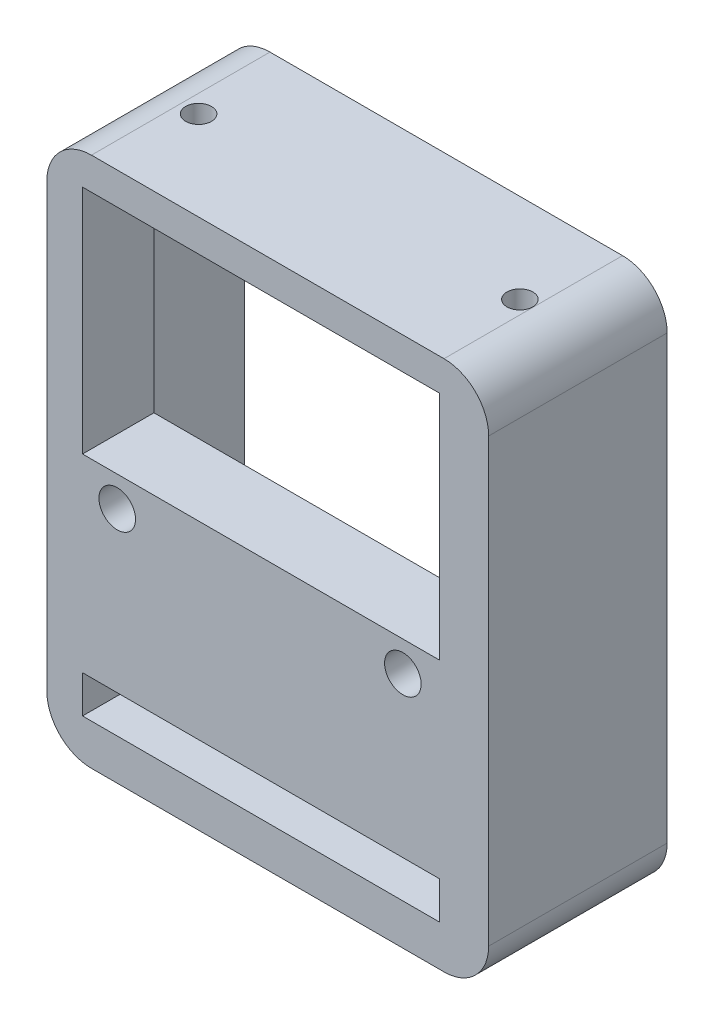
ISO-10303-21;
HEADER;
FILE_DESCRIPTION(('STEP AP214'),'2;1');
FILE_NAME('part.step','',(''),(''),'','','');
FILE_SCHEMA(('AUTOMOTIVE_DESIGN { 1 0 10303 214 1 1 1 1 }'));
ENDSEC;
DATA;
#1=APPLICATION_CONTEXT('core data for automotive mechanical design processes');
#2=APPLICATION_PROTOCOL_DEFINITION('international standard','automotive_design',2000,#1);
#3=PRODUCT_CONTEXT('',#1,'mechanical');
#4=PRODUCT('Part','Part','',(#3));
#5=PRODUCT_RELATED_PRODUCT_CATEGORY('part','',(#4));
#6=PRODUCT_DEFINITION_FORMATION('','',#4);
#7=PRODUCT_DEFINITION_CONTEXT('part definition',#1,'design');
#8=PRODUCT_DEFINITION('design','',#6,#7);
#9=PRODUCT_DEFINITION_SHAPE('','',#8);
#10=(LENGTH_UNIT() NAMED_UNIT(*) SI_UNIT(.MILLI.,.METRE.));
#11=(NAMED_UNIT(*) PLANE_ANGLE_UNIT() SI_UNIT($,.RADIAN.));
#12=(NAMED_UNIT(*) SI_UNIT($,.STERADIAN.) SOLID_ANGLE_UNIT());
#13=UNCERTAINTY_MEASURE_WITH_UNIT(LENGTH_MEASURE(1.E-05),#10,'distance_accuracy_value','');
#14=(GEOMETRIC_REPRESENTATION_CONTEXT(3) GLOBAL_UNCERTAINTY_ASSIGNED_CONTEXT((#13)) GLOBAL_UNIT_ASSIGNED_CONTEXT((#10,
#11,#12)) REPRESENTATION_CONTEXT('',''));
#15=CARTESIAN_POINT('',(0.,0.,0.));
#16=DIRECTION('',(0.,0.,1.));
#17=DIRECTION('',(1.,0.,0.));
#18=AXIS2_PLACEMENT_3D('',#15,#16,#17);
#19=CARTESIAN_POINT('',(15.138,-3.116,20.));
#20=DIRECTION('',(0.,0.,-1.));
#21=DIRECTION('',(-1.,0.,0.));
#22=AXIS2_PLACEMENT_3D('',#19,#20,#21);
#23=CYLINDRICAL_SURFACE('',#22,1.45);
#24=CARTESIAN_POINT('',(15.138,-3.116,12.));
#25=DIRECTION('',(0.,0.,-1.));
#26=DIRECTION('',(-1.,0.,0.));
#27=AXIS2_PLACEMENT_3D('',#24,#25,#26);
#28=CIRCLE('',#27,1.45);
#29=CARTESIAN_POINT('',(13.688,-3.116,12.));
#30=VERTEX_POINT('',#29);
#31=EDGE_CURVE('E343',#30,#30,#28,.T.);
#32=ORIENTED_EDGE('',*,*,#31,.T.);
#33=EDGE_LOOP('',(#32));
#34=FACE_BOUND('',#33,.T.);
#35=CARTESIAN_POINT('',(15.138,-3.116,14.));
#36=DIRECTION('',(0.,0.,1.));
#37=DIRECTION('',(1.,0.,0.));
#38=AXIS2_PLACEMENT_3D('',#35,#36,#37);
#39=CIRCLE('',#38,1.45);
#40=CARTESIAN_POINT('',(16.588,-3.116,14.));
#41=VERTEX_POINT('',#40);
#42=EDGE_CURVE('E339',#41,#41,#39,.F.);
#43=ORIENTED_EDGE('',*,*,#42,.F.);
#44=EDGE_LOOP('',(#43));
#45=FACE_BOUND('',#44,.T.);
#46=ADVANCED_FACE('F41',(#34,#45),#23,.F.);
#47=CARTESIAN_POINT('',(-16.862,-3.116,20.));
#48=DIRECTION('',(0.,0.,-1.));
#49=DIRECTION('',(-1.,0.,0.));
#50=AXIS2_PLACEMENT_3D('',#47,#48,#49);
#51=CYLINDRICAL_SURFACE('',#50,1.45);
#52=CARTESIAN_POINT('',(-16.862,-3.116,12.));
#53=DIRECTION('',(0.,0.,-1.));
#54=DIRECTION('',(-1.,0.,0.));
#55=AXIS2_PLACEMENT_3D('',#52,#53,#54);
#56=CIRCLE('',#55,1.45);
#57=CARTESIAN_POINT('',(-18.312,-3.116,12.));
#58=VERTEX_POINT('',#57);
#59=EDGE_CURVE('E215',#58,#58,#56,.T.);
#60=ORIENTED_EDGE('',*,*,#59,.T.);
#61=EDGE_LOOP('',(#60));
#62=FACE_BOUND('',#61,.T.);
#63=CARTESIAN_POINT('',(-16.862,-3.116,14.));
#64=DIRECTION('',(0.,0.,1.));
#65=DIRECTION('',(1.,0.,0.));
#66=AXIS2_PLACEMENT_3D('',#63,#64,#65);
#67=CIRCLE('',#66,1.45);
#68=CARTESIAN_POINT('',(-15.412,-3.116,14.));
#69=VERTEX_POINT('',#68);
#70=EDGE_CURVE('E336',#69,#69,#67,.F.);
#71=ORIENTED_EDGE('',*,*,#70,.F.);
#72=EDGE_LOOP('',(#71));
#73=FACE_BOUND('',#72,.T.);
#74=ADVANCED_FACE('F416',(#62,#73),#51,.F.);
#75=CARTESIAN_POINT('',(19.75,-24.75,20.));
#76=DIRECTION('',(0.,0.,1.));
#77=DIRECTION('',(1.,0.,0.));
#78=AXIS2_PLACEMENT_3D('',#75,#76,#77);
#79=PLANE('',#78);
#80=CARTESIAN_POINT('',(-16.862,-3.116,20.));
#81=DIRECTION('',(0.,0.,1.));
#82=DIRECTION('',(1.,0.,0.));
#83=AXIS2_PLACEMENT_3D('',#80,#81,#82);
#84=CIRCLE('',#83,2.05);
#85=CARTESIAN_POINT('',(-14.812,-3.116,20.));
#86=VERTEX_POINT('',#85);
#87=EDGE_CURVE('E372',#86,#86,#84,.T.);
#88=ORIENTED_EDGE('',*,*,#87,.F.);
#89=EDGE_LOOP('',(#88));
#90=FACE_BOUND('',#89,.T.);
#91=CARTESIAN_POINT('',(15.138,-3.116,20.));
#92=DIRECTION('',(0.,0.,1.));
#93=DIRECTION('',(1.,0.,0.));
#94=AXIS2_PLACEMENT_3D('',#91,#92,#93);
#95=CIRCLE('',#94,2.05);
#96=CARTESIAN_POINT('',(17.188,-3.116,20.));
#97=VERTEX_POINT('',#96);
#98=EDGE_CURVE('E375',#97,#97,#95,.T.);
#99=ORIENTED_EDGE('',*,*,#98,.F.);
#100=EDGE_LOOP('',(#99));
#101=FACE_BOUND('',#100,.T.);
#102=CARTESIAN_POINT('',(19.75,-24.75,20.));
#103=DIRECTION('',(0.,0.,1.));
#104=DIRECTION('',(1.,0.,0.));
#105=AXIS2_PLACEMENT_3D('',#102,#103,#104);
#106=CIRCLE('',#105,4.99999999999999);
#107=CARTESIAN_POINT('',(19.75,-29.75,20.));
#108=VERTEX_POINT('',#107);
#109=CARTESIAN_POINT('',(24.75,-24.75,20.));
#110=VERTEX_POINT('',#109);
#111=EDGE_CURVE('E264',#108,#110,#106,.T.);
#112=ORIENTED_EDGE('',*,*,#111,.T.);
#113=DIRECTION('',(0.,1.,0.));
#114=VECTOR('',#113,1.);
#115=CARTESIAN_POINT('',(24.75,24.75,20.));
#116=LINE('',#115,#114);
#117=CARTESIAN_POINT('',(24.75,24.75,20.));
#118=VERTEX_POINT('',#117);
#119=EDGE_CURVE('E267',#110,#118,#116,.T.);
#120=ORIENTED_EDGE('',*,*,#119,.T.);
#121=CARTESIAN_POINT('',(19.75,24.75,20.));
#122=DIRECTION('',(0.,0.,1.));
#123=DIRECTION('',(-1.,0.,0.));
#124=AXIS2_PLACEMENT_3D('',#121,#122,#123);
#125=CIRCLE('',#124,4.99999999999999);
#126=CARTESIAN_POINT('',(19.75,29.75,20.));
#127=VERTEX_POINT('',#126);
#128=EDGE_CURVE('E270',#118,#127,#125,.T.);
#129=ORIENTED_EDGE('',*,*,#128,.T.);
#130=DIRECTION('',(-1.,0.,0.));
#131=VECTOR('',#130,1.);
#132=CARTESIAN_POINT('',(-19.75,29.75,20.));
#133=LINE('',#132,#131);
#134=CARTESIAN_POINT('',(-19.75,29.75,20.));
#135=VERTEX_POINT('',#134);
#136=EDGE_CURVE('E272',#127,#135,#133,.T.);
#137=ORIENTED_EDGE('',*,*,#136,.T.);
#138=CARTESIAN_POINT('',(-19.75,24.75,20.));
#139=DIRECTION('',(0.,0.,1.));
#140=DIRECTION('',(1.,0.,0.));
#141=AXIS2_PLACEMENT_3D('',#138,#139,#140);
#142=CIRCLE('',#141,4.99999999999999);
#143=CARTESIAN_POINT('',(-24.75,24.75,20.));
#144=VERTEX_POINT('',#143);
#145=EDGE_CURVE('E274',#135,#144,#142,.T.);
#146=ORIENTED_EDGE('',*,*,#145,.T.);
#147=DIRECTION('',(0.,-1.,0.));
#148=VECTOR('',#147,1.);
#149=CARTESIAN_POINT('',(-24.75,24.75,20.));
#150=LINE('',#149,#148);
#151=CARTESIAN_POINT('',(-24.75,-24.75,20.));
#152=VERTEX_POINT('',#151);
#153=EDGE_CURVE('E276',#144,#152,#150,.T.);
#154=ORIENTED_EDGE('',*,*,#153,.T.);
#155=CARTESIAN_POINT('',(-19.75,-24.75,20.));
#156=DIRECTION('',(0.,0.,1.));
#157=DIRECTION('',(1.,0.,0.));
#158=AXIS2_PLACEMENT_3D('',#155,#156,#157);
#159=CIRCLE('',#158,4.99999999999999);
#160=CARTESIAN_POINT('',(-19.75,-29.75,20.));
#161=VERTEX_POINT('',#160);
#162=EDGE_CURVE('E278',#152,#161,#159,.T.);
#163=ORIENTED_EDGE('',*,*,#162,.T.);
#164=DIRECTION('',(1.,0.,0.));
#165=VECTOR('',#164,1.);
#166=CARTESIAN_POINT('',(-19.75,-29.75,20.));
#167=LINE('',#166,#165);
#168=EDGE_CURVE('E280',#161,#108,#167,.T.);
#169=ORIENTED_EDGE('',*,*,#168,.T.);
#170=EDGE_LOOP('',(#112,#120,#129,#137,#146,#154,#163,#169));
#171=FACE_BOUND('',#170,.T.);
#172=DIRECTION('',(1.,0.,0.));
#173=VECTOR('',#172,1.);
#174=CARTESIAN_POINT('',(0.,-20.9650496624066,20.));
#175=LINE('',#174,#173);
#176=CARTESIAN_POINT('',(-20.75,-20.9650496624066,20.));
#177=VERTEX_POINT('',#176);
#178=CARTESIAN_POINT('',(19.25,-20.9650496624066,20.));
#179=VERTEX_POINT('',#178);
#180=EDGE_CURVE('E214',#177,#179,#175,.T.);
#181=ORIENTED_EDGE('',*,*,#180,.T.);
#182=DIRECTION('',(0.,-1.,0.));
#183=VECTOR('',#182,1.);
#184=CARTESIAN_POINT('',(19.25,0.,20.));
#185=LINE('',#184,#183);
#186=CARTESIAN_POINT('',(19.25,-25.1650496624066,20.));
#187=VERTEX_POINT('',#186);
#188=EDGE_CURVE('E66',#179,#187,#185,.T.);
#189=ORIENTED_EDGE('',*,*,#188,.T.);
#190=DIRECTION('',(1.,0.,0.));
#191=VECTOR('',#190,1.);
#192=CARTESIAN_POINT('',(0.,-25.1650496624066,20.));
#193=LINE('',#192,#191);
#194=CARTESIAN_POINT('',(-20.75,-25.1650496624066,20.));
#195=VERTEX_POINT('',#194);
#196=EDGE_CURVE('E221',#195,#187,#193,.T.);
#197=ORIENTED_EDGE('',*,*,#196,.F.);
#198=DIRECTION('',(0.,-1.,0.));
#199=VECTOR('',#198,1.);
#200=CARTESIAN_POINT('',(-20.75,0.,20.));
#201=LINE('',#200,#199);
#202=EDGE_CURVE('E218',#177,#195,#201,.T.);
#203=ORIENTED_EDGE('',*,*,#202,.F.);
#204=EDGE_LOOP('',(#181,#189,#197,#203));
#205=FACE_BOUND('',#204,.T.);
#206=DIRECTION('',(1.,0.,0.));
#207=VECTOR('',#206,1.);
#208=CARTESIAN_POINT('',(0.,26.15,20.));
#209=LINE('',#208,#207);
#210=CARTESIAN_POINT('',(-20.75,26.15,20.));
#211=VERTEX_POINT('',#210);
#212=CARTESIAN_POINT('',(19.25,26.15,20.));
#213=VERTEX_POINT('',#212);
#214=EDGE_CURVE('E197',#211,#213,#209,.T.);
#215=ORIENTED_EDGE('',*,*,#214,.T.);
#216=DIRECTION('',(0.,-1.,0.));
#217=VECTOR('',#216,1.);
#218=CARTESIAN_POINT('',(19.25,0.,20.));
#219=LINE('',#218,#217);
#220=CARTESIAN_POINT('',(19.25,0.249999999999993,20.));
#221=VERTEX_POINT('',#220);
#222=EDGE_CURVE('E58',#213,#221,#219,.T.);
#223=ORIENTED_EDGE('',*,*,#222,.T.);
#224=DIRECTION('',(1.,0.,0.));
#225=VECTOR('',#224,1.);
#226=CARTESIAN_POINT('',(0.,0.249999999999993,20.));
#227=LINE('',#226,#225);
#228=CARTESIAN_POINT('',(-20.75,0.249999999999993,20.));
#229=VERTEX_POINT('',#228);
#230=EDGE_CURVE('E203',#229,#221,#227,.T.);
#231=ORIENTED_EDGE('',*,*,#230,.F.);
#232=DIRECTION('',(0.,-1.,0.));
#233=VECTOR('',#232,1.);
#234=CARTESIAN_POINT('',(-20.75,0.,20.));
#235=LINE('',#234,#233);
#236=EDGE_CURVE('E187',#211,#229,#235,.T.);
#237=ORIENTED_EDGE('',*,*,#236,.F.);
#238=EDGE_LOOP('',(#215,#223,#231,#237));
#239=FACE_BOUND('',#238,.T.);
#240=ADVANCED_FACE('F201',(#90,#101,#171,#205,#239),#79,.T.);
#241=CARTESIAN_POINT('',(0.,0.,12.));
#242=DIRECTION('',(0.,0.,-1.));
#243=DIRECTION('',(-1.,0.,0.));
#244=AXIS2_PLACEMENT_3D('',#241,#242,#243);
#245=PLANE('',#244);
#246=ORIENTED_EDGE('',*,*,#59,.F.);
#247=EDGE_LOOP('',(#246));
#248=FACE_BOUND('',#247,.T.);
#249=ORIENTED_EDGE('',*,*,#31,.F.);
#250=EDGE_LOOP('',(#249));
#251=FACE_BOUND('',#250,.T.);
#252=DIRECTION('',(0.,1.,0.));
#253=VECTOR('',#252,1.);
#254=CARTESIAN_POINT('',(-22.6,27.6,12.));
#255=LINE('',#254,#253);
#256=CARTESIAN_POINT('',(-22.6,-27.6,12.));
#257=VERTEX_POINT('',#256);
#258=CARTESIAN_POINT('',(-22.6,27.6,12.));
#259=VERTEX_POINT('',#258);
#260=EDGE_CURVE('E232',#257,#259,#255,.T.);
#261=ORIENTED_EDGE('',*,*,#260,.T.);
#262=DIRECTION('',(1.,0.,0.));
#263=VECTOR('',#262,1.);
#264=CARTESIAN_POINT('',(22.6,27.6,12.));
#265=LINE('',#264,#263);
#266=CARTESIAN_POINT('',(22.6,27.6,12.));
#267=VERTEX_POINT('',#266);
#268=EDGE_CURVE('E235',#259,#267,#265,.T.);
#269=ORIENTED_EDGE('',*,*,#268,.T.);
#270=DIRECTION('',(0.,-1.,0.));
#271=VECTOR('',#270,1.);
#272=CARTESIAN_POINT('',(22.6,27.6,12.));
#273=LINE('',#272,#271);
#274=CARTESIAN_POINT('',(22.6,-27.6,12.));
#275=VERTEX_POINT('',#274);
#276=EDGE_CURVE('E239',#267,#275,#273,.T.);
#277=ORIENTED_EDGE('',*,*,#276,.T.);
#278=DIRECTION('',(-1.,0.,0.));
#279=VECTOR('',#278,1.);
#280=CARTESIAN_POINT('',(22.6,-27.6,12.));
#281=LINE('',#280,#279);
#282=EDGE_CURVE('E242',#275,#257,#281,.T.);
#283=ORIENTED_EDGE('',*,*,#282,.T.);
#284=EDGE_LOOP('',(#261,#269,#277,#283));
#285=FACE_BOUND('',#284,.T.);
#286=DIRECTION('',(-1.,0.,0.));
#287=VECTOR('',#286,1.);
#288=CARTESIAN_POINT('',(0.,-25.1650496624066,12.));
#289=LINE('',#288,#287);
#290=CARTESIAN_POINT('',(19.25,-25.1650496624066,12.));
#291=VERTEX_POINT('',#290);
#292=CARTESIAN_POINT('',(-20.75,-25.1650496624066,12.));
#293=VERTEX_POINT('',#292);
#294=EDGE_CURVE('E327',#291,#293,#289,.T.);
#295=ORIENTED_EDGE('',*,*,#294,.F.);
#296=DIRECTION('',(0.,1.,0.));
#297=VECTOR('',#296,1.);
#298=CARTESIAN_POINT('',(19.25,0.,12.));
#299=LINE('',#298,#297);
#300=CARTESIAN_POINT('',(19.25,-20.9650496624066,12.));
#301=VERTEX_POINT('',#300);
#302=EDGE_CURVE('E329',#291,#301,#299,.T.);
#303=ORIENTED_EDGE('',*,*,#302,.T.);
#304=DIRECTION('',(-1.,0.,0.));
#305=VECTOR('',#304,1.);
#306=CARTESIAN_POINT('',(0.,-20.9650496624066,12.));
#307=LINE('',#306,#305);
#308=CARTESIAN_POINT('',(-20.75,-20.9650496624066,12.));
#309=VERTEX_POINT('',#308);
#310=EDGE_CURVE('E321',#301,#309,#307,.T.);
#311=ORIENTED_EDGE('',*,*,#310,.T.);
#312=DIRECTION('',(0.,1.,0.));
#313=VECTOR('',#312,1.);
#314=CARTESIAN_POINT('',(-20.75,0.,12.));
#315=LINE('',#314,#313);
#316=EDGE_CURVE('E324',#293,#309,#315,.T.);
#317=ORIENTED_EDGE('',*,*,#316,.F.);
#318=EDGE_LOOP('',(#295,#303,#311,#317));
#319=FACE_BOUND('',#318,.T.);
#320=DIRECTION('',(-1.,0.,0.));
#321=VECTOR('',#320,1.);
#322=CARTESIAN_POINT('',(0.,0.249999999999993,12.));
#323=LINE('',#322,#321);
#324=CARTESIAN_POINT('',(19.25,0.249999999999993,12.));
#325=VERTEX_POINT('',#324);
#326=CARTESIAN_POINT('',(-20.75,0.249999999999993,12.));
#327=VERTEX_POINT('',#326);
#328=EDGE_CURVE('E50',#325,#327,#323,.T.);
#329=ORIENTED_EDGE('',*,*,#328,.F.);
#330=DIRECTION('',(0.,1.,0.));
#331=VECTOR('',#330,1.);
#332=CARTESIAN_POINT('',(19.25,0.,12.));
#333=LINE('',#332,#331);
#334=CARTESIAN_POINT('',(19.25,26.15,12.));
#335=VERTEX_POINT('',#334);
#336=EDGE_CURVE('E11',#325,#335,#333,.T.);
#337=ORIENTED_EDGE('',*,*,#336,.T.);
#338=DIRECTION('',(-1.,0.,0.));
#339=VECTOR('',#338,1.);
#340=CARTESIAN_POINT('',(0.,26.15,12.));
#341=LINE('',#340,#339);
#342=CARTESIAN_POINT('',(-20.75,26.15,12.));
#343=VERTEX_POINT('',#342);
#344=EDGE_CURVE('E332',#335,#343,#341,.T.);
#345=ORIENTED_EDGE('',*,*,#344,.T.);
#346=DIRECTION('',(0.,1.,0.));
#347=VECTOR('',#346,1.);
#348=CARTESIAN_POINT('',(-20.75,0.,12.));
#349=LINE('',#348,#347);
#350=EDGE_CURVE('E190',#327,#343,#349,.T.);
#351=ORIENTED_EDGE('',*,*,#350,.F.);
#352=EDGE_LOOP('',(#329,#337,#345,#351));
#353=FACE_BOUND('',#352,.T.);
#354=ADVANCED_FACE('F387',(#248,#251,#285,#319,#353),#245,.T.);
#355=CARTESIAN_POINT('',(19.75,-24.75,20.));
#356=DIRECTION('',(0.,0.,-1.));
#357=DIRECTION('',(-1.,0.,0.));
#358=AXIS2_PLACEMENT_3D('',#355,#356,#357);
#359=CYLINDRICAL_SURFACE('',#358,4.99999999999999);
#360=CARTESIAN_POINT('',(19.75,-24.75,0.));
#361=DIRECTION('',(0.,0.,1.));
#362=DIRECTION('',(1.,0.,0.));
#363=AXIS2_PLACEMENT_3D('',#360,#361,#362);
#364=CIRCLE('',#363,4.99999999999999);
#365=CARTESIAN_POINT('',(19.75,-29.75,0.));
#366=VERTEX_POINT('',#365);
#367=CARTESIAN_POINT('',(24.75,-24.75,0.));
#368=VERTEX_POINT('',#367);
#369=EDGE_CURVE('E257',#366,#368,#364,.T.);
#370=ORIENTED_EDGE('',*,*,#369,.T.);
#371=DIRECTION('',(0.,0.,-1.));
#372=VECTOR('',#371,1.);
#373=CARTESIAN_POINT('',(24.75,-24.75,20.));
#374=LINE('',#373,#372);
#375=EDGE_CURVE('E318',#110,#368,#374,.T.);
#376=ORIENTED_EDGE('',*,*,#375,.F.);
#377=ORIENTED_EDGE('',*,*,#111,.F.);
#378=DIRECTION('',(0.,0.,-1.));
#379=VECTOR('',#378,1.);
#380=CARTESIAN_POINT('',(19.75,-29.75,20.));
#381=LINE('',#380,#379);
#382=EDGE_CURVE('E282',#108,#366,#381,.T.);
#383=ORIENTED_EDGE('',*,*,#382,.T.);
#384=EDGE_LOOP('',(#370,#376,#377,#383));
#385=FACE_BOUND('',#384,.T.);
#386=ADVANCED_FACE('F43',(#385),#359,.T.);
#387=CARTESIAN_POINT('',(24.75,24.75,20.));
#388=DIRECTION('',(-1.,0.,0.));
#389=DIRECTION('',(0.,0.,1.));
#390=AXIS2_PLACEMENT_3D('',#387,#388,#389);
#391=PLANE('',#390);
#392=DIRECTION('',(0.,1.,0.));
#393=VECTOR('',#392,1.);
#394=CARTESIAN_POINT('',(24.75,24.75,0.));
#395=LINE('',#394,#393);
#396=CARTESIAN_POINT('',(24.75,24.75,0.));
#397=VERTEX_POINT('',#396);
#398=EDGE_CURVE('E285',#368,#397,#395,.T.);
#399=ORIENTED_EDGE('',*,*,#398,.T.);
#400=DIRECTION('',(0.,0.,-1.));
#401=VECTOR('',#400,1.);
#402=CARTESIAN_POINT('',(24.75,24.75,20.));
#403=LINE('',#402,#401);
#404=EDGE_CURVE('E315',#118,#397,#403,.T.);
#405=ORIENTED_EDGE('',*,*,#404,.F.);
#406=ORIENTED_EDGE('',*,*,#119,.F.);
#407=ORIENTED_EDGE('',*,*,#375,.T.);
#408=EDGE_LOOP('',(#399,#405,#406,#407));
#409=FACE_BOUND('',#408,.T.);
#410=ADVANCED_FACE('F524',(#409),#391,.F.);
#411=CARTESIAN_POINT('',(19.75,24.75,20.));
#412=DIRECTION('',(0.,0.,-1.));
#413=DIRECTION('',(-1.,0.,0.));
#414=AXIS2_PLACEMENT_3D('',#411,#412,#413);
#415=CYLINDRICAL_SURFACE('',#414,4.99999999999999);
#416=CARTESIAN_POINT('',(19.75,24.75,0.));
#417=DIRECTION('',(0.,0.,1.));
#418=DIRECTION('',(-1.,0.,0.));
#419=AXIS2_PLACEMENT_3D('',#416,#417,#418);
#420=CIRCLE('',#419,4.99999999999999);
#421=CARTESIAN_POINT('',(19.75,29.75,0.));
#422=VERTEX_POINT('',#421);
#423=EDGE_CURVE('E287',#397,#422,#420,.T.);
#424=ORIENTED_EDGE('',*,*,#423,.T.);
#425=DIRECTION('',(0.,0.,-1.));
#426=VECTOR('',#425,1.);
#427=CARTESIAN_POINT('',(19.75,29.75,20.));
#428=LINE('',#427,#426);
#429=EDGE_CURVE('E312',#127,#422,#428,.T.);
#430=ORIENTED_EDGE('',*,*,#429,.F.);
#431=ORIENTED_EDGE('',*,*,#128,.F.);
#432=ORIENTED_EDGE('',*,*,#404,.T.);
#433=EDGE_LOOP('',(#424,#430,#431,#432));
#434=FACE_BOUND('',#433,.T.);
#435=ADVANCED_FACE('F521',(#434),#415,.T.);
#436=CARTESIAN_POINT('',(-19.75,29.75,20.));
#437=DIRECTION('',(0.,-1.,0.));
#438=DIRECTION('',(0.,0.,-1.));
#439=AXIS2_PLACEMENT_3D('',#436,#437,#438);
#440=PLANE('',#439);
#441=CARTESIAN_POINT('',(-17.75,29.75,10.));
#442=DIRECTION('',(0.,1.,0.));
#443=DIRECTION('',(0.,0.,1.));
#444=AXIS2_PLACEMENT_3D('',#441,#442,#443);
#445=CIRCLE('',#444,1.45);
#446=CARTESIAN_POINT('',(-17.75,29.75,11.45));
#447=VERTEX_POINT('',#446);
#448=EDGE_CURVE('E348',#447,#447,#445,.T.);
#449=ORIENTED_EDGE('',*,*,#448,.F.);
#450=EDGE_LOOP('',(#449));
#451=FACE_BOUND('',#450,.T.);
#452=CARTESIAN_POINT('',(18.25,29.75,10.));
#453=DIRECTION('',(0.,1.,0.));
#454=DIRECTION('',(0.,0.,1.));
#455=AXIS2_PLACEMENT_3D('',#452,#453,#454);
#456=CIRCLE('',#455,1.45);
#457=CARTESIAN_POINT('',(18.25,29.75,11.45));
#458=VERTEX_POINT('',#457);
#459=EDGE_CURVE('E357',#458,#458,#456,.T.);
#460=ORIENTED_EDGE('',*,*,#459,.F.);
#461=EDGE_LOOP('',(#460));
#462=FACE_BOUND('',#461,.T.);
#463=DIRECTION('',(-1.,0.,0.));
#464=VECTOR('',#463,1.);
#465=CARTESIAN_POINT('',(-19.75,29.75,0.));
#466=LINE('',#465,#464);
#467=CARTESIAN_POINT('',(-19.75,29.75,0.));
#468=VERTEX_POINT('',#467);
#469=EDGE_CURVE('E289',#422,#468,#466,.T.);
#470=ORIENTED_EDGE('',*,*,#469,.T.);
#471=DIRECTION('',(0.,0.,-1.));
#472=VECTOR('',#471,1.);
#473=CARTESIAN_POINT('',(-19.75,29.75,20.));
#474=LINE('',#473,#472);
#475=EDGE_CURVE('E309',#135,#468,#474,.T.);
#476=ORIENTED_EDGE('',*,*,#475,.F.);
#477=ORIENTED_EDGE('',*,*,#136,.F.);
#478=ORIENTED_EDGE('',*,*,#429,.T.);
#479=EDGE_LOOP('',(#470,#476,#477,#478));
#480=FACE_BOUND('',#479,.T.);
#481=ADVANCED_FACE('F517',(#451,#462,#480),#440,.F.);
#482=CARTESIAN_POINT('',(-19.75,24.75,20.));
#483=DIRECTION('',(0.,0.,-1.));
#484=DIRECTION('',(-1.,0.,0.));
#485=AXIS2_PLACEMENT_3D('',#482,#483,#484);
#486=CYLINDRICAL_SURFACE('',#485,4.99999999999999);
#487=CARTESIAN_POINT('',(-19.75,24.75,0.));
#488=DIRECTION('',(0.,0.,1.));
#489=DIRECTION('',(1.,0.,0.));
#490=AXIS2_PLACEMENT_3D('',#487,#488,#489);
#491=CIRCLE('',#490,4.99999999999999);
#492=CARTESIAN_POINT('',(-24.75,24.75,0.));
#493=VERTEX_POINT('',#492);
#494=EDGE_CURVE('E291',#468,#493,#491,.T.);
#495=ORIENTED_EDGE('',*,*,#494,.T.);
#496=DIRECTION('',(0.,0.,-1.));
#497=VECTOR('',#496,1.);
#498=CARTESIAN_POINT('',(-24.75,24.75,20.));
#499=LINE('',#498,#497);
#500=EDGE_CURVE('E306',#144,#493,#499,.T.);
#501=ORIENTED_EDGE('',*,*,#500,.F.);
#502=ORIENTED_EDGE('',*,*,#145,.F.);
#503=ORIENTED_EDGE('',*,*,#475,.T.);
#504=EDGE_LOOP('',(#495,#501,#502,#503));
#505=FACE_BOUND('',#504,.T.);
#506=ADVANCED_FACE('F513',(#505),#486,.T.);
#507=CARTESIAN_POINT('',(-24.75,24.75,20.));
#508=DIRECTION('',(1.,0.,0.));
#509=DIRECTION('',(0.,0.,-1.));
#510=AXIS2_PLACEMENT_3D('',#507,#508,#509);
#511=PLANE('',#510);
#512=DIRECTION('',(0.,-1.,0.));
#513=VECTOR('',#512,1.);
#514=CARTESIAN_POINT('',(-24.75,24.75,0.));
#515=LINE('',#514,#513);
#516=CARTESIAN_POINT('',(-24.75,-24.75,0.));
#517=VERTEX_POINT('',#516);
#518=EDGE_CURVE('E293',#493,#517,#515,.T.);
#519=ORIENTED_EDGE('',*,*,#518,.T.);
#520=DIRECTION('',(0.,0.,-1.));
#521=VECTOR('',#520,1.);
#522=CARTESIAN_POINT('',(-24.75,-24.75,20.));
#523=LINE('',#522,#521);
#524=EDGE_CURVE('E303',#152,#517,#523,.T.);
#525=ORIENTED_EDGE('',*,*,#524,.F.);
#526=ORIENTED_EDGE('',*,*,#153,.F.);
#527=ORIENTED_EDGE('',*,*,#500,.T.);
#528=EDGE_LOOP('',(#519,#525,#526,#527));
#529=FACE_BOUND('',#528,.T.);
#530=ADVANCED_FACE('F509',(#529),#511,.F.);
#531=CARTESIAN_POINT('',(-19.75,-24.75,20.));
#532=DIRECTION('',(0.,0.,-1.));
#533=DIRECTION('',(-1.,0.,0.));
#534=AXIS2_PLACEMENT_3D('',#531,#532,#533);
#535=CYLINDRICAL_SURFACE('',#534,4.99999999999999);
#536=CARTESIAN_POINT('',(-19.75,-24.75,0.));
#537=DIRECTION('',(0.,0.,1.));
#538=DIRECTION('',(1.,0.,0.));
#539=AXIS2_PLACEMENT_3D('',#536,#537,#538);
#540=CIRCLE('',#539,4.99999999999999);
#541=CARTESIAN_POINT('',(-19.75,-29.75,0.));
#542=VERTEX_POINT('',#541);
#543=EDGE_CURVE('E295',#517,#542,#540,.T.);
#544=ORIENTED_EDGE('',*,*,#543,.T.);
#545=DIRECTION('',(0.,0.,-1.));
#546=VECTOR('',#545,1.);
#547=CARTESIAN_POINT('',(-19.75,-29.75,20.));
#548=LINE('',#547,#546);
#549=EDGE_CURVE('E300',#161,#542,#548,.T.);
#550=ORIENTED_EDGE('',*,*,#549,.F.);
#551=ORIENTED_EDGE('',*,*,#162,.F.);
#552=ORIENTED_EDGE('',*,*,#524,.T.);
#553=EDGE_LOOP('',(#544,#550,#551,#552));
#554=FACE_BOUND('',#553,.T.);
#555=ADVANCED_FACE('F505',(#554),#535,.T.);
#556=CARTESIAN_POINT('',(-19.75,-29.75,20.));
#557=DIRECTION('',(0.,1.,0.));
#558=DIRECTION('',(0.,0.,1.));
#559=AXIS2_PLACEMENT_3D('',#556,#557,#558);
#560=PLANE('',#559);
#561=CARTESIAN_POINT('',(-10.,-29.75,10.));
#562=DIRECTION('',(0.,-1.,0.));
#563=DIRECTION('',(0.,0.,-1.));
#564=AXIS2_PLACEMENT_3D('',#561,#562,#563);
#565=CIRCLE('',#564,1.45);
#566=CARTESIAN_POINT('',(-10.,-29.75,8.55));
#567=VERTEX_POINT('',#566);
#568=EDGE_CURVE('E353',#567,#567,#565,.T.);
#569=ORIENTED_EDGE('',*,*,#568,.F.);
#570=EDGE_LOOP('',(#569));
#571=FACE_BOUND('',#570,.T.);
#572=CARTESIAN_POINT('',(10.,-29.75,10.));
#573=DIRECTION('',(0.,-1.,0.));
#574=DIRECTION('',(0.,0.,-1.));
#575=AXIS2_PLACEMENT_3D('',#572,#573,#574);
#576=CIRCLE('',#575,1.45);
#577=CARTESIAN_POINT('',(10.,-29.75,8.55));
#578=VERTEX_POINT('',#577);
#579=EDGE_CURVE('E359',#578,#578,#576,.T.);
#580=ORIENTED_EDGE('',*,*,#579,.F.);
#581=EDGE_LOOP('',(#580));
#582=FACE_BOUND('',#581,.T.);
#583=DIRECTION('',(1.,0.,0.));
#584=VECTOR('',#583,1.);
#585=CARTESIAN_POINT('',(-19.75,-29.75,0.));
#586=LINE('',#585,#584);
#587=EDGE_CURVE('E268',#542,#366,#586,.T.);
#588=ORIENTED_EDGE('',*,*,#587,.T.);
#589=ORIENTED_EDGE('',*,*,#382,.F.);
#590=ORIENTED_EDGE('',*,*,#168,.F.);
#591=ORIENTED_EDGE('',*,*,#549,.T.);
#592=EDGE_LOOP('',(#588,#589,#590,#591));
#593=FACE_BOUND('',#592,.T.);
#594=ADVANCED_FACE('F501',(#571,#582,#593),#560,.F.);
#595=CARTESIAN_POINT('',(19.75,-24.75,0.));
#596=DIRECTION('',(0.,0.,1.));
#597=DIRECTION('',(1.,0.,0.));
#598=AXIS2_PLACEMENT_3D('',#595,#596,#597);
#599=PLANE('',#598);
#600=DIRECTION('',(1.,0.,0.));
#601=VECTOR('',#600,1.);
#602=CARTESIAN_POINT('',(22.6,27.6,0.));
#603=LINE('',#602,#601);
#604=CARTESIAN_POINT('',(-22.6,27.6,0.));
#605=VERTEX_POINT('',#604);
#606=CARTESIAN_POINT('',(22.6,27.6,0.));
#607=VERTEX_POINT('',#606);
#608=EDGE_CURVE('E247',#605,#607,#603,.T.);
#609=ORIENTED_EDGE('',*,*,#608,.F.);
#610=DIRECTION('',(0.,1.,0.));
#611=VECTOR('',#610,1.);
#612=CARTESIAN_POINT('',(-22.6,27.6,0.));
#613=LINE('',#612,#611);
#614=CARTESIAN_POINT('',(-22.6,-27.6,0.));
#615=VERTEX_POINT('',#614);
#616=EDGE_CURVE('E210',#615,#605,#613,.T.);
#617=ORIENTED_EDGE('',*,*,#616,.F.);
#618=DIRECTION('',(-1.,0.,0.));
#619=VECTOR('',#618,1.);
#620=CARTESIAN_POINT('',(22.6,-27.6,0.));
#621=LINE('',#620,#619);
#622=CARTESIAN_POINT('',(22.6,-27.6,0.));
#623=VERTEX_POINT('',#622);
#624=EDGE_CURVE('E236',#623,#615,#621,.T.);
#625=ORIENTED_EDGE('',*,*,#624,.F.);
#626=DIRECTION('',(0.,-1.,0.));
#627=VECTOR('',#626,1.);
#628=CARTESIAN_POINT('',(22.6,27.6,0.));
#629=LINE('',#628,#627);
#630=EDGE_CURVE('E250',#607,#623,#629,.T.);
#631=ORIENTED_EDGE('',*,*,#630,.F.);
#632=EDGE_LOOP('',(#609,#617,#625,#631));
#633=FACE_BOUND('',#632,.T.);
#634=ORIENTED_EDGE('',*,*,#369,.F.);
#635=ORIENTED_EDGE('',*,*,#587,.F.);
#636=ORIENTED_EDGE('',*,*,#543,.F.);
#637=ORIENTED_EDGE('',*,*,#518,.F.);
#638=ORIENTED_EDGE('',*,*,#494,.F.);
#639=ORIENTED_EDGE('',*,*,#469,.F.);
#640=ORIENTED_EDGE('',*,*,#423,.F.);
#641=ORIENTED_EDGE('',*,*,#398,.F.);
#642=EDGE_LOOP('',(#634,#635,#636,#637,#638,#639,#640,#641));
#643=FACE_BOUND('',#642,.T.);
#644=ADVANCED_FACE('F496',(#633,#643),#599,.F.);
#645=CARTESIAN_POINT('',(-22.6,27.6,12.));
#646=DIRECTION('',(-1.,0.,0.));
#647=DIRECTION('',(0.,0.,1.));
#648=AXIS2_PLACEMENT_3D('',#645,#646,#647);
#649=PLANE('',#648);
#650=ORIENTED_EDGE('',*,*,#616,.T.);
#651=DIRECTION('',(0.,0.,-1.));
#652=VECTOR('',#651,1.);
#653=CARTESIAN_POINT('',(-22.6,27.6,12.));
#654=LINE('',#653,#652);
#655=EDGE_CURVE('E245',#259,#605,#654,.T.);
#656=ORIENTED_EDGE('',*,*,#655,.F.);
#657=ORIENTED_EDGE('',*,*,#260,.F.);
#658=DIRECTION('',(0.,0.,-1.));
#659=VECTOR('',#658,1.);
#660=CARTESIAN_POINT('',(-22.6,-27.6,12.));
#661=LINE('',#660,#659);
#662=EDGE_CURVE('E255',#257,#615,#661,.T.);
#663=ORIENTED_EDGE('',*,*,#662,.T.);
#664=EDGE_LOOP('',(#650,#656,#657,#663));
#665=FACE_BOUND('',#664,.T.);
#666=ADVANCED_FACE('F487',(#665),#649,.F.);
#667=CARTESIAN_POINT('',(22.6,-27.6,12.));
#668=DIRECTION('',(0.,-1.,0.));
#669=DIRECTION('',(0.,0.,-1.));
#670=AXIS2_PLACEMENT_3D('',#667,#668,#669);
#671=PLANE('',#670);
#672=CARTESIAN_POINT('',(-10.,-27.6,10.));
#673=DIRECTION('',(0.,-1.,0.));
#674=DIRECTION('',(0.,0.,-1.));
#675=AXIS2_PLACEMENT_3D('',#672,#673,#674);
#676=CIRCLE('',#675,1.45);
#677=CARTESIAN_POINT('',(-10.,-27.6,8.55));
#678=VERTEX_POINT('',#677);
#679=EDGE_CURVE('E45',#678,#678,#676,.T.);
#680=ORIENTED_EDGE('',*,*,#679,.T.);
#681=EDGE_LOOP('',(#680));
#682=FACE_BOUND('',#681,.T.);
#683=CARTESIAN_POINT('',(10.,-27.6,10.));
#684=DIRECTION('',(0.,-1.,0.));
#685=DIRECTION('',(0.,0.,-1.));
#686=AXIS2_PLACEMENT_3D('',#683,#684,#685);
#687=CIRCLE('',#686,1.45);
#688=CARTESIAN_POINT('',(10.,-27.6,8.55));
#689=VERTEX_POINT('',#688);
#690=EDGE_CURVE('E351',#689,#689,#687,.T.);
#691=ORIENTED_EDGE('',*,*,#690,.T.);
#692=EDGE_LOOP('',(#691));
#693=FACE_BOUND('',#692,.T.);
#694=ORIENTED_EDGE('',*,*,#624,.T.);
#695=ORIENTED_EDGE('',*,*,#662,.F.);
#696=ORIENTED_EDGE('',*,*,#282,.F.);
#697=DIRECTION('',(0.,0.,-1.));
#698=VECTOR('',#697,1.);
#699=CARTESIAN_POINT('',(22.6,-27.6,12.));
#700=LINE('',#699,#698);
#701=EDGE_CURVE('E258',#275,#623,#700,.T.);
#702=ORIENTED_EDGE('',*,*,#701,.T.);
#703=EDGE_LOOP('',(#694,#695,#696,#702));
#704=FACE_BOUND('',#703,.T.);
#705=ADVANCED_FACE('F483',(#682,#693,#704),#671,.F.);
#706=CARTESIAN_POINT('',(22.6,27.6,12.));
#707=DIRECTION('',(1.,0.,0.));
#708=DIRECTION('',(0.,0.,-1.));
#709=AXIS2_PLACEMENT_3D('',#706,#707,#708);
#710=PLANE('',#709);
#711=ORIENTED_EDGE('',*,*,#630,.T.);
#712=ORIENTED_EDGE('',*,*,#701,.F.);
#713=ORIENTED_EDGE('',*,*,#276,.F.);
#714=DIRECTION('',(0.,0.,-1.));
#715=VECTOR('',#714,1.);
#716=CARTESIAN_POINT('',(22.6,27.6,12.));
#717=LINE('',#716,#715);
#718=EDGE_CURVE('E260',#267,#607,#717,.T.);
#719=ORIENTED_EDGE('',*,*,#718,.T.);
#720=EDGE_LOOP('',(#711,#712,#713,#719));
#721=FACE_BOUND('',#720,.T.);
#722=ADVANCED_FACE('F486',(#721),#710,.F.);
#723=CARTESIAN_POINT('',(22.6,27.6,12.));
#724=DIRECTION('',(0.,1.,0.));
#725=DIRECTION('',(0.,0.,1.));
#726=AXIS2_PLACEMENT_3D('',#723,#724,#725);
#727=PLANE('',#726);
#728=CARTESIAN_POINT('',(-17.75,27.6,10.));
#729=DIRECTION('',(0.,1.,0.));
#730=DIRECTION('',(0.,0.,1.));
#731=AXIS2_PLACEMENT_3D('',#728,#729,#730);
#732=CIRCLE('',#731,1.45);
#733=CARTESIAN_POINT('',(-17.75,27.6,11.45));
#734=VERTEX_POINT('',#733);
#735=EDGE_CURVE('E347',#734,#734,#732,.T.);
#736=ORIENTED_EDGE('',*,*,#735,.T.);
#737=EDGE_LOOP('',(#736));
#738=FACE_BOUND('',#737,.T.);
#739=CARTESIAN_POINT('',(18.25,27.6,10.));
#740=DIRECTION('',(0.,1.,0.));
#741=DIRECTION('',(0.,0.,1.));
#742=AXIS2_PLACEMENT_3D('',#739,#740,#741);
#743=CIRCLE('',#742,1.45);
#744=CARTESIAN_POINT('',(18.25,27.6,11.45));
#745=VERTEX_POINT('',#744);
#746=EDGE_CURVE('E344',#745,#745,#743,.T.);
#747=ORIENTED_EDGE('',*,*,#746,.T.);
#748=EDGE_LOOP('',(#747));
#749=FACE_BOUND('',#748,.T.);
#750=ORIENTED_EDGE('',*,*,#608,.T.);
#751=ORIENTED_EDGE('',*,*,#718,.F.);
#752=ORIENTED_EDGE('',*,*,#268,.F.);
#753=ORIENTED_EDGE('',*,*,#655,.T.);
#754=EDGE_LOOP('',(#750,#751,#752,#753));
#755=FACE_BOUND('',#754,.T.);
#756=ADVANCED_FACE('F480',(#738,#749,#755),#727,.F.);
#757=CARTESIAN_POINT('',(19.25,0.,0.));
#758=DIRECTION('',(-1.,0.,0.));
#759=DIRECTION('',(0.,0.,1.));
#760=AXIS2_PLACEMENT_3D('',#757,#758,#759);
#761=PLANE('',#760);
#762=DIRECTION('',(0.,0.,1.));
#763=VECTOR('',#762,1.);
#764=CARTESIAN_POINT('',(19.25,-25.1650496624066,0.));
#765=LINE('',#764,#763);
#766=EDGE_CURVE('E225',#291,#187,#765,.T.);
#767=ORIENTED_EDGE('',*,*,#766,.T.);
#768=ORIENTED_EDGE('',*,*,#188,.F.);
#769=DIRECTION('',(0.,0.,1.));
#770=VECTOR('',#769,1.);
#771=CARTESIAN_POINT('',(19.25,-20.9650496624066,0.));
#772=LINE('',#771,#770);
#773=EDGE_CURVE('E224',#301,#179,#772,.T.);
#774=ORIENTED_EDGE('',*,*,#773,.F.);
#775=ORIENTED_EDGE('',*,*,#302,.F.);
#776=EDGE_LOOP('',(#767,#768,#774,#775));
#777=FACE_BOUND('',#776,.T.);
#778=ADVANCED_FACE('F468',(#777),#761,.T.);
#779=CARTESIAN_POINT('',(0.,-25.1650496624066,0.));
#780=DIRECTION('',(0.,-1.,0.));
#781=DIRECTION('',(0.,0.,-1.));
#782=AXIS2_PLACEMENT_3D('',#779,#780,#781);
#783=PLANE('',#782);
#784=ORIENTED_EDGE('',*,*,#294,.T.);
#785=DIRECTION('',(0.,0.,1.));
#786=VECTOR('',#785,1.);
#787=CARTESIAN_POINT('',(-20.75,-25.1650496624066,0.));
#788=LINE('',#787,#786);
#789=EDGE_CURVE('E227',#293,#195,#788,.T.);
#790=ORIENTED_EDGE('',*,*,#789,.T.);
#791=ORIENTED_EDGE('',*,*,#196,.T.);
#792=ORIENTED_EDGE('',*,*,#766,.F.);
#793=EDGE_LOOP('',(#784,#790,#791,#792));
#794=FACE_BOUND('',#793,.T.);
#795=ADVANCED_FACE('F473',(#794),#783,.F.);
#796=CARTESIAN_POINT('',(-20.75,0.,0.));
#797=DIRECTION('',(-1.,0.,0.));
#798=DIRECTION('',(0.,-1.,0.));
#799=AXIS2_PLACEMENT_3D('',#796,#797,#798);
#800=PLANE('',#799);
#801=ORIENTED_EDGE('',*,*,#316,.T.);
#802=DIRECTION('',(0.,0.,1.));
#803=VECTOR('',#802,1.);
#804=CARTESIAN_POINT('',(-20.75,-20.9650496624066,0.));
#805=LINE('',#804,#803);
#806=EDGE_CURVE('E229',#309,#177,#805,.T.);
#807=ORIENTED_EDGE('',*,*,#806,.T.);
#808=ORIENTED_EDGE('',*,*,#202,.T.);
#809=ORIENTED_EDGE('',*,*,#789,.F.);
#810=EDGE_LOOP('',(#801,#807,#808,#809));
#811=FACE_BOUND('',#810,.T.);
#812=ADVANCED_FACE('F410',(#811),#800,.F.);
#813=CARTESIAN_POINT('',(0.,-20.9650496624066,0.));
#814=DIRECTION('',(0.,-1.,0.));
#815=DIRECTION('',(0.,0.,-1.));
#816=AXIS2_PLACEMENT_3D('',#813,#814,#815);
#817=PLANE('',#816);
#818=ORIENTED_EDGE('',*,*,#773,.T.);
#819=ORIENTED_EDGE('',*,*,#180,.F.);
#820=ORIENTED_EDGE('',*,*,#806,.F.);
#821=ORIENTED_EDGE('',*,*,#310,.F.);
#822=EDGE_LOOP('',(#818,#819,#820,#821));
#823=FACE_BOUND('',#822,.T.);
#824=ADVANCED_FACE('F403',(#823),#817,.T.);
#825=CARTESIAN_POINT('',(19.25,0.,0.));
#826=DIRECTION('',(-1.,0.,0.));
#827=DIRECTION('',(0.,-1.,0.));
#828=AXIS2_PLACEMENT_3D('',#825,#826,#827);
#829=PLANE('',#828);
#830=DIRECTION('',(0.,0.,1.));
#831=VECTOR('',#830,1.);
#832=CARTESIAN_POINT('',(19.25,0.249999999999993,0.));
#833=LINE('',#832,#831);
#834=EDGE_CURVE('E208',#325,#221,#833,.T.);
#835=ORIENTED_EDGE('',*,*,#834,.T.);
#836=ORIENTED_EDGE('',*,*,#222,.F.);
#837=DIRECTION('',(0.,0.,1.));
#838=VECTOR('',#837,1.);
#839=CARTESIAN_POINT('',(19.25,26.15,0.));
#840=LINE('',#839,#838);
#841=EDGE_CURVE('E194',#335,#213,#840,.T.);
#842=ORIENTED_EDGE('',*,*,#841,.F.);
#843=ORIENTED_EDGE('',*,*,#336,.F.);
#844=EDGE_LOOP('',(#835,#836,#842,#843));
#845=FACE_BOUND('',#844,.T.);
#846=ADVANCED_FACE('F401',(#845),#829,.T.);
#847=CARTESIAN_POINT('',(0.,0.249999999999993,0.));
#848=DIRECTION('',(0.,-1.,0.));
#849=DIRECTION('',(0.,0.,-1.));
#850=AXIS2_PLACEMENT_3D('',#847,#848,#849);
#851=PLANE('',#850);
#852=ORIENTED_EDGE('',*,*,#328,.T.);
#853=DIRECTION('',(0.,0.,1.));
#854=VECTOR('',#853,1.);
#855=CARTESIAN_POINT('',(-20.75,0.249999999999993,0.));
#856=LINE('',#855,#854);
#857=EDGE_CURVE('E193',#327,#229,#856,.T.);
#858=ORIENTED_EDGE('',*,*,#857,.T.);
#859=ORIENTED_EDGE('',*,*,#230,.T.);
#860=ORIENTED_EDGE('',*,*,#834,.F.);
#861=EDGE_LOOP('',(#852,#858,#859,#860));
#862=FACE_BOUND('',#861,.T.);
#863=ADVANCED_FACE('F400',(#862),#851,.F.);
#864=CARTESIAN_POINT('',(-20.75,0.,0.));
#865=DIRECTION('',(-1.,0.,0.));
#866=DIRECTION('',(0.,-1.,0.));
#867=AXIS2_PLACEMENT_3D('',#864,#865,#866);
#868=PLANE('',#867);
#869=ORIENTED_EDGE('',*,*,#350,.T.);
#870=DIRECTION('',(0.,0.,1.));
#871=VECTOR('',#870,1.);
#872=CARTESIAN_POINT('',(-20.75,26.15,0.));
#873=LINE('',#872,#871);
#874=EDGE_CURVE('E182',#343,#211,#873,.T.);
#875=ORIENTED_EDGE('',*,*,#874,.T.);
#876=ORIENTED_EDGE('',*,*,#236,.T.);
#877=ORIENTED_EDGE('',*,*,#857,.F.);
#878=EDGE_LOOP('',(#869,#875,#876,#877));
#879=FACE_BOUND('',#878,.T.);
#880=ADVANCED_FACE('F184',(#879),#868,.F.);
#881=CARTESIAN_POINT('',(0.,26.15,0.));
#882=DIRECTION('',(0.,-1.,0.));
#883=DIRECTION('',(0.,0.,-1.));
#884=AXIS2_PLACEMENT_3D('',#881,#882,#883);
#885=PLANE('',#884);
#886=ORIENTED_EDGE('',*,*,#841,.T.);
#887=ORIENTED_EDGE('',*,*,#214,.F.);
#888=ORIENTED_EDGE('',*,*,#874,.F.);
#889=ORIENTED_EDGE('',*,*,#344,.F.);
#890=EDGE_LOOP('',(#886,#887,#888,#889));
#891=FACE_BOUND('',#890,.T.);
#892=ADVANCED_FACE('F198',(#891),#885,.T.);
#893=CARTESIAN_POINT('',(-16.862,-3.116,14.));
#894=DIRECTION('',(0.,0.,1.));
#895=DIRECTION('',(1.,0.,0.));
#896=AXIS2_PLACEMENT_3D('',#893,#894,#895);
#897=PLANE('',#896);
#898=CARTESIAN_POINT('',(-16.862,-3.116,14.));
#899=DIRECTION('',(0.,0.,1.));
#900=DIRECTION('',(1.,0.,0.));
#901=AXIS2_PLACEMENT_3D('',#898,#899,#900);
#902=CIRCLE('',#901,2.05);
#903=CARTESIAN_POINT('',(-14.812,-3.116,14.));
#904=VERTEX_POINT('',#903);
#905=EDGE_CURVE('E340',#904,#904,#902,.T.);
#906=ORIENTED_EDGE('',*,*,#905,.T.);
#907=EDGE_LOOP('',(#906));
#908=FACE_BOUND('',#907,.T.);
#909=ORIENTED_EDGE('',*,*,#70,.T.);
#910=EDGE_LOOP('',(#909));
#911=FACE_BOUND('',#910,.T.);
#912=ADVANCED_FACE('F427',(#908,#911),#897,.T.);
#913=CARTESIAN_POINT('',(-16.862,-3.116,14.));
#914=DIRECTION('',(0.,0.,1.));
#915=DIRECTION('',(1.,0.,0.));
#916=AXIS2_PLACEMENT_3D('',#913,#914,#915);
#917=CYLINDRICAL_SURFACE('',#916,2.05);
#918=ORIENTED_EDGE('',*,*,#905,.F.);
#919=EDGE_LOOP('',(#918));
#920=FACE_BOUND('',#919,.T.);
#921=ORIENTED_EDGE('',*,*,#87,.T.);
#922=EDGE_LOOP('',(#921));
#923=FACE_BOUND('',#922,.T.);
#924=ADVANCED_FACE('F431',(#920,#923),#917,.F.);
#925=CARTESIAN_POINT('',(15.138,-3.116,14.));
#926=DIRECTION('',(0.,0.,1.));
#927=DIRECTION('',(1.,0.,0.));
#928=AXIS2_PLACEMENT_3D('',#925,#926,#927);
#929=PLANE('',#928);
#930=CARTESIAN_POINT('',(15.138,-3.116,14.));
#931=DIRECTION('',(0.,0.,1.));
#932=DIRECTION('',(1.,0.,0.));
#933=AXIS2_PLACEMENT_3D('',#930,#931,#932);
#934=CIRCLE('',#933,2.05);
#935=CARTESIAN_POINT('',(17.188,-3.116,14.));
#936=VERTEX_POINT('',#935);
#937=EDGE_CURVE('E350',#936,#936,#934,.T.);
#938=ORIENTED_EDGE('',*,*,#937,.T.);
#939=EDGE_LOOP('',(#938));
#940=FACE_BOUND('',#939,.T.);
#941=ORIENTED_EDGE('',*,*,#42,.T.);
#942=EDGE_LOOP('',(#941));
#943=FACE_BOUND('',#942,.T.);
#944=ADVANCED_FACE('F437',(#940,#943),#929,.T.);
#945=CARTESIAN_POINT('',(15.138,-3.116,14.));
#946=DIRECTION('',(0.,0.,1.));
#947=DIRECTION('',(1.,0.,0.));
#948=AXIS2_PLACEMENT_3D('',#945,#946,#947);
#949=CYLINDRICAL_SURFACE('',#948,2.05);
#950=ORIENTED_EDGE('',*,*,#937,.F.);
#951=EDGE_LOOP('',(#950));
#952=FACE_BOUND('',#951,.T.);
#953=ORIENTED_EDGE('',*,*,#98,.T.);
#954=EDGE_LOOP('',(#953));
#955=FACE_BOUND('',#954,.T.);
#956=ADVANCED_FACE('F445',(#952,#955),#949,.F.);
#957=CARTESIAN_POINT('',(18.25,23.75,10.));
#958=DIRECTION('',(0.,1.,0.));
#959=DIRECTION('',(0.,0.,1.));
#960=AXIS2_PLACEMENT_3D('',#957,#958,#959);
#961=CYLINDRICAL_SURFACE('',#960,1.45);
#962=ORIENTED_EDGE('',*,*,#459,.T.);
#963=EDGE_LOOP('',(#962));
#964=FACE_BOUND('',#963,.T.);
#965=ORIENTED_EDGE('',*,*,#746,.F.);
#966=EDGE_LOOP('',(#965));
#967=FACE_BOUND('',#966,.T.);
#968=ADVANCED_FACE('F442',(#964,#967),#961,.F.);
#969=CARTESIAN_POINT('',(-17.75,23.75,10.));
#970=DIRECTION('',(0.,1.,0.));
#971=DIRECTION('',(0.,0.,1.));
#972=AXIS2_PLACEMENT_3D('',#969,#970,#971);
#973=CYLINDRICAL_SURFACE('',#972,1.45);
#974=ORIENTED_EDGE('',*,*,#448,.T.);
#975=EDGE_LOOP('',(#974));
#976=FACE_BOUND('',#975,.T.);
#977=ORIENTED_EDGE('',*,*,#735,.F.);
#978=EDGE_LOOP('',(#977));
#979=FACE_BOUND('',#978,.T.);
#980=ADVANCED_FACE('F607',(#976,#979),#973,.F.);
#981=CARTESIAN_POINT('',(10.,-23.75,10.));
#982=DIRECTION('',(0.,-1.,0.));
#983=DIRECTION('',(0.,0.,-1.));
#984=AXIS2_PLACEMENT_3D('',#981,#982,#983);
#985=CYLINDRICAL_SURFACE('',#984,1.45);
#986=ORIENTED_EDGE('',*,*,#579,.T.);
#987=EDGE_LOOP('',(#986));
#988=FACE_BOUND('',#987,.T.);
#989=ORIENTED_EDGE('',*,*,#690,.F.);
#990=EDGE_LOOP('',(#989));
#991=FACE_BOUND('',#990,.T.);
#992=ADVANCED_FACE('F616',(#988,#991),#985,.F.);
#993=CARTESIAN_POINT('',(-10.,-23.75,10.));
#994=DIRECTION('',(0.,-1.,0.));
#995=DIRECTION('',(0.,0.,-1.));
#996=AXIS2_PLACEMENT_3D('',#993,#994,#995);
#997=CYLINDRICAL_SURFACE('',#996,1.45);
#998=ORIENTED_EDGE('',*,*,#568,.T.);
#999=EDGE_LOOP('',(#998));
#1000=FACE_BOUND('',#999,.T.);
#1001=ORIENTED_EDGE('',*,*,#679,.F.);
#1002=EDGE_LOOP('',(#1001));
#1003=FACE_BOUND('',#1002,.T.);
#1004=ADVANCED_FACE('F625',(#1000,#1003),#997,.F.);
#1005=CLOSED_SHELL('',(#46,#74,#240,#354,#386,#410,#435,#481,#506,#530,#555,#594,#644,#666,#705,
#722,#756,#778,#795,#812,#824,#846,#863,#880,#892,#912,#924,#944,#956,#968,#980,#992,#1004));
#1006=MANIFOLD_SOLID_BREP('B2',#1005);
#1007=ADVANCED_BREP_SHAPE_REPRESENTATION('',(#18,#1006),#14);
#1008=SHAPE_DEFINITION_REPRESENTATION(#9,#1007);
ENDSEC;
END-ISO-10303-21;
